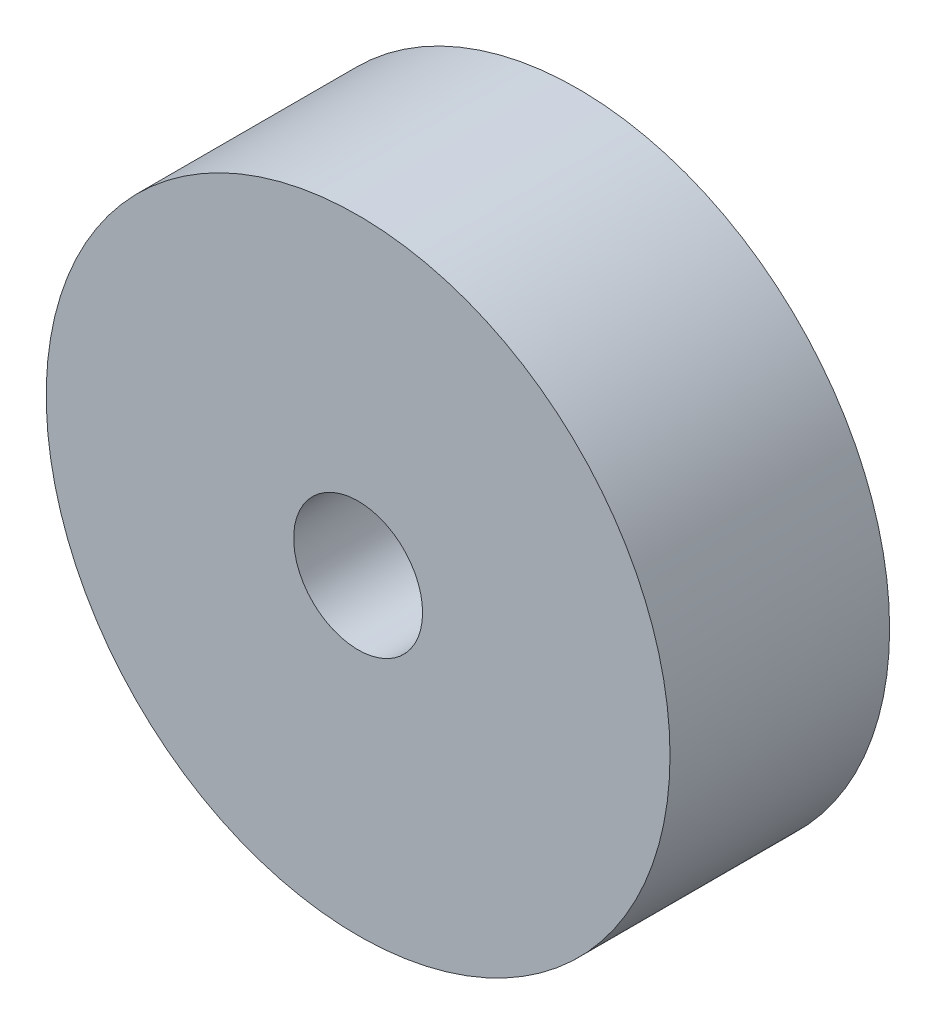
ISO-10303-21;
HEADER;
FILE_DESCRIPTION(('STEP AP214'),'2;1');
FILE_NAME('part.step','',(''),(''),'','','');
FILE_SCHEMA(('AUTOMOTIVE_DESIGN { 1 0 10303 214 1 1 1 1 }'));
ENDSEC;
DATA;
#1=APPLICATION_CONTEXT('core data for automotive mechanical design processes');
#2=APPLICATION_PROTOCOL_DEFINITION('international standard','automotive_design',2000,#1);
#3=PRODUCT_CONTEXT('',#1,'mechanical');
#4=PRODUCT('Part','Part','',(#3));
#5=PRODUCT_RELATED_PRODUCT_CATEGORY('part','',(#4));
#6=PRODUCT_DEFINITION_FORMATION('','',#4);
#7=PRODUCT_DEFINITION_CONTEXT('part definition',#1,'design');
#8=PRODUCT_DEFINITION('design','',#6,#7);
#9=PRODUCT_DEFINITION_SHAPE('','',#8);
#10=(LENGTH_UNIT() NAMED_UNIT(*) SI_UNIT(.MILLI.,.METRE.));
#11=(NAMED_UNIT(*) PLANE_ANGLE_UNIT() SI_UNIT($,.RADIAN.));
#12=(NAMED_UNIT(*) SI_UNIT($,.STERADIAN.) SOLID_ANGLE_UNIT());
#13=UNCERTAINTY_MEASURE_WITH_UNIT(LENGTH_MEASURE(1.E-05),#10,'distance_accuracy_value','');
#14=(GEOMETRIC_REPRESENTATION_CONTEXT(3) GLOBAL_UNCERTAINTY_ASSIGNED_CONTEXT((#13)) GLOBAL_UNIT_ASSIGNED_CONTEXT((#10,
#11,#12)) REPRESENTATION_CONTEXT('',''));
#15=CARTESIAN_POINT('',(0.,0.,0.));
#16=DIRECTION('',(0.,0.,1.));
#17=DIRECTION('',(1.,0.,0.));
#18=AXIS2_PLACEMENT_3D('',#15,#16,#17);
#19=CARTESIAN_POINT('',(0.,0.,26.4));
#20=DIRECTION('',(0.,0.,1.));
#21=DIRECTION('',(1.,0.,0.));
#22=AXIS2_PLACEMENT_3D('',#19,#20,#21);
#23=PLANE('',#22);
#24=CARTESIAN_POINT('',(0.,0.,26.4));
#25=DIRECTION('',(0.,0.,1.));
#26=DIRECTION('',(1.,0.,0.));
#27=AXIS2_PLACEMENT_3D('',#24,#25,#26);
#28=CIRCLE('',#27,37.5);
#29=CARTESIAN_POINT('',(37.5,0.,26.4));
#30=VERTEX_POINT('',#29);
#31=EDGE_CURVE('E10',#30,#30,#28,.T.);
#32=ORIENTED_EDGE('',*,*,#31,.T.);
#33=EDGE_LOOP('',(#32));
#34=FACE_BOUND('',#33,.T.);
#35=CARTESIAN_POINT('',(0.,0.,26.4));
#36=DIRECTION('',(0.,0.,1.));
#37=DIRECTION('',(1.,0.,0.));
#38=AXIS2_PLACEMENT_3D('',#35,#36,#37);
#39=CIRCLE('',#38,7.75);
#40=CARTESIAN_POINT('',(7.75,0.,26.4));
#41=VERTEX_POINT('',#40);
#42=EDGE_CURVE('E42',#41,#41,#39,.T.);
#43=ORIENTED_EDGE('',*,*,#42,.F.);
#44=EDGE_LOOP('',(#43));
#45=FACE_BOUND('',#44,.T.);
#46=ADVANCED_FACE('F31',(#34,#45),#23,.T.);
#47=CARTESIAN_POINT('',(0.,0.,0.));
#48=DIRECTION('',(0.,0.,1.));
#49=DIRECTION('',(1.,0.,0.));
#50=AXIS2_PLACEMENT_3D('',#47,#48,#49);
#51=PLANE('',#50);
#52=CARTESIAN_POINT('',(0.,0.,0.));
#53=DIRECTION('',(0.,0.,1.));
#54=DIRECTION('',(1.,0.,0.));
#55=AXIS2_PLACEMENT_3D('',#52,#53,#54);
#56=CIRCLE('',#55,37.5);
#57=CARTESIAN_POINT('',(37.5,0.,0.));
#58=VERTEX_POINT('',#57);
#59=EDGE_CURVE('E35',#58,#58,#56,.T.);
#60=ORIENTED_EDGE('',*,*,#59,.F.);
#61=EDGE_LOOP('',(#60));
#62=FACE_BOUND('',#61,.T.);
#63=CARTESIAN_POINT('',(0.,0.,0.));
#64=DIRECTION('',(0.,0.,1.));
#65=DIRECTION('',(1.,0.,0.));
#66=AXIS2_PLACEMENT_3D('',#63,#64,#65);
#67=CIRCLE('',#66,7.75);
#68=CARTESIAN_POINT('',(7.75,0.,0.));
#69=VERTEX_POINT('',#68);
#70=EDGE_CURVE('E44',#69,#69,#67,.T.);
#71=ORIENTED_EDGE('',*,*,#70,.T.);
#72=EDGE_LOOP('',(#71));
#73=FACE_BOUND('',#72,.T.);
#74=ADVANCED_FACE('F54',(#62,#73),#51,.F.);
#75=CARTESIAN_POINT('',(0.,0.,26.4));
#76=DIRECTION('',(0.,0.,-1.));
#77=DIRECTION('',(-1.,0.,0.));
#78=AXIS2_PLACEMENT_3D('',#75,#76,#77);
#79=CYLINDRICAL_SURFACE('',#78,37.5);
#80=ORIENTED_EDGE('',*,*,#31,.F.);
#81=EDGE_LOOP('',(#80));
#82=FACE_BOUND('',#81,.T.);
#83=ORIENTED_EDGE('',*,*,#59,.T.);
#84=EDGE_LOOP('',(#83));
#85=FACE_BOUND('',#84,.T.);
#86=ADVANCED_FACE('F33',(#82,#85),#79,.T.);
#87=CARTESIAN_POINT('',(0.,0.,26.4));
#88=DIRECTION('',(0.,0.,-1.));
#89=DIRECTION('',(-1.,0.,0.));
#90=AXIS2_PLACEMENT_3D('',#87,#88,#89);
#91=CYLINDRICAL_SURFACE('',#90,7.75);
#92=ORIENTED_EDGE('',*,*,#42,.T.);
#93=EDGE_LOOP('',(#92));
#94=FACE_BOUND('',#93,.T.);
#95=ORIENTED_EDGE('',*,*,#70,.F.);
#96=EDGE_LOOP('',(#95));
#97=FACE_BOUND('',#96,.T.);
#98=ADVANCED_FACE('F50',(#94,#97),#91,.F.);
#99=CLOSED_SHELL('',(#46,#74,#86,#98));
#100=MANIFOLD_SOLID_BREP('B2',#99);
#101=ADVANCED_BREP_SHAPE_REPRESENTATION('',(#18,#100),#14);
#102=SHAPE_DEFINITION_REPRESENTATION(#9,#101);
ENDSEC;
END-ISO-10303-21;
